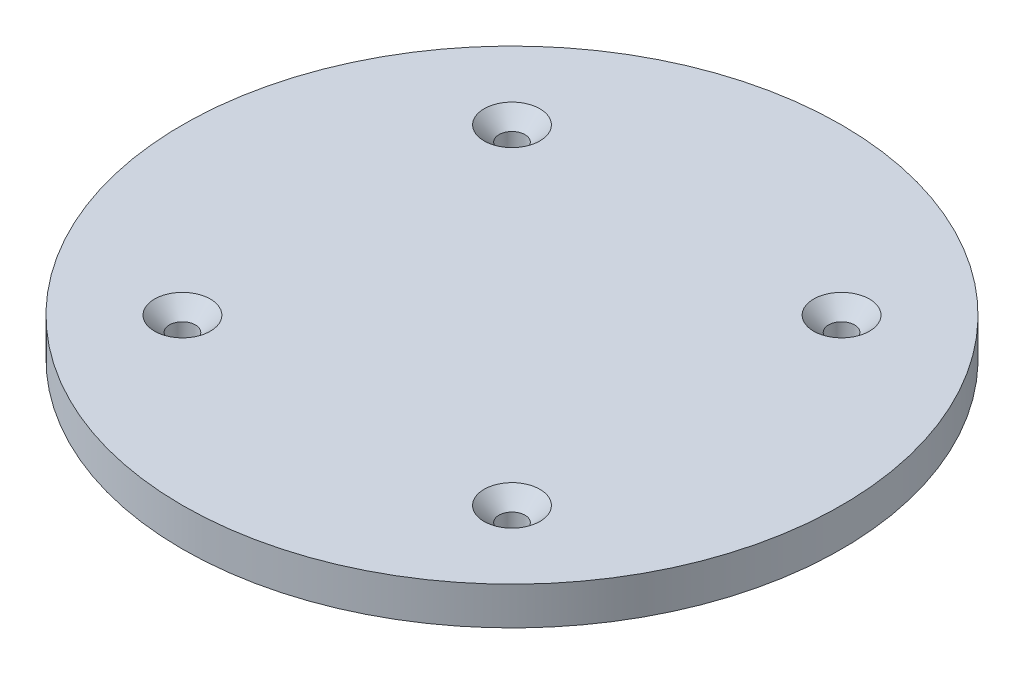
ISO-10303-21;
HEADER;
FILE_DESCRIPTION(('STEP AP214'),'2;1');
FILE_NAME('part.step','',(''),(''),'','','');
FILE_SCHEMA(('AUTOMOTIVE_DESIGN { 1 0 10303 214 1 1 1 1 }'));
ENDSEC;
DATA;
#1=APPLICATION_CONTEXT('core data for automotive mechanical design processes');
#2=APPLICATION_PROTOCOL_DEFINITION('international standard','automotive_design',2000,#1);
#3=PRODUCT_CONTEXT('',#1,'mechanical');
#4=PRODUCT('Part','Part','',(#3));
#5=PRODUCT_RELATED_PRODUCT_CATEGORY('part','',(#4));
#6=PRODUCT_DEFINITION_FORMATION('','',#4);
#7=PRODUCT_DEFINITION_CONTEXT('part definition',#1,'design');
#8=PRODUCT_DEFINITION('design','',#6,#7);
#9=PRODUCT_DEFINITION_SHAPE('','',#8);
#10=(LENGTH_UNIT() NAMED_UNIT(*) SI_UNIT(.MILLI.,.METRE.));
#11=(NAMED_UNIT(*) PLANE_ANGLE_UNIT() SI_UNIT($,.RADIAN.));
#12=(NAMED_UNIT(*) SI_UNIT($,.STERADIAN.) SOLID_ANGLE_UNIT());
#13=UNCERTAINTY_MEASURE_WITH_UNIT(LENGTH_MEASURE(1.E-05),#10,'distance_accuracy_value','');
#14=(GEOMETRIC_REPRESENTATION_CONTEXT(3) GLOBAL_UNCERTAINTY_ASSIGNED_CONTEXT((#13)) GLOBAL_UNIT_ASSIGNED_CONTEXT((#10,
#11,#12)) REPRESENTATION_CONTEXT('',''));
#15=CARTESIAN_POINT('',(0.,0.,0.));
#16=DIRECTION('',(0.,0.,1.));
#17=DIRECTION('',(1.,0.,0.));
#18=AXIS2_PLACEMENT_3D('',#15,#16,#17);
#19=CARTESIAN_POINT('',(-25.4,5.842,-25.4));
#20=DIRECTION('',(0.,-1.,0.));
#21=DIRECTION('',(0.,0.,-1.));
#22=AXIS2_PLACEMENT_3D('',#19,#20,#21);
#23=CYLINDRICAL_SURFACE('',#22,2.);
#24=CARTESIAN_POINT('',(-25.4,3.54199999999997,-25.4));
#25=DIRECTION('',(0.,1.,0.));
#26=DIRECTION('',(0.,0.,1.));
#27=AXIS2_PLACEMENT_3D('',#24,#25,#26);
#28=CIRCLE('',#27,2.);
#29=CARTESIAN_POINT('',(-25.4,3.54199999999997,-23.4));
#30=VERTEX_POINT('',#29);
#31=EDGE_CURVE('E49',#30,#30,#28,.T.);
#32=ORIENTED_EDGE('',*,*,#31,.T.);
#33=EDGE_LOOP('',(#32));
#34=FACE_BOUND('',#33,.T.);
#35=CARTESIAN_POINT('',(-25.4,0.,-25.4));
#36=DIRECTION('',(0.,1.,0.));
#37=DIRECTION('',(0.,0.,1.));
#38=AXIS2_PLACEMENT_3D('',#35,#36,#37);
#39=CIRCLE('',#38,2.);
#40=CARTESIAN_POINT('',(-25.4,0.,-23.4));
#41=VERTEX_POINT('',#40);
#42=EDGE_CURVE('E78',#41,#41,#39,.T.);
#43=ORIENTED_EDGE('',*,*,#42,.F.);
#44=EDGE_LOOP('',(#43));
#45=FACE_BOUND('',#44,.T.);
#46=ADVANCED_FACE('F41',(#34,#45),#23,.F.);
#47=CARTESIAN_POINT('',(25.4,5.842,25.4));
#48=DIRECTION('',(0.,-1.,0.));
#49=DIRECTION('',(0.,0.,-1.));
#50=AXIS2_PLACEMENT_3D('',#47,#48,#49);
#51=CYLINDRICAL_SURFACE('',#50,2.);
#52=CARTESIAN_POINT('',(25.4,3.54199999999997,25.4));
#53=DIRECTION('',(0.,1.,0.));
#54=DIRECTION('',(0.,0.,1.));
#55=AXIS2_PLACEMENT_3D('',#52,#53,#54);
#56=CIRCLE('',#55,2.);
#57=CARTESIAN_POINT('',(25.4,3.54199999999997,27.4));
#58=VERTEX_POINT('',#57);
#59=EDGE_CURVE('E71',#58,#58,#56,.T.);
#60=ORIENTED_EDGE('',*,*,#59,.T.);
#61=EDGE_LOOP('',(#60));
#62=FACE_BOUND('',#61,.T.);
#63=CARTESIAN_POINT('',(25.4,0.,25.4));
#64=DIRECTION('',(0.,1.,0.));
#65=DIRECTION('',(0.,0.,1.));
#66=AXIS2_PLACEMENT_3D('',#63,#64,#65);
#67=CIRCLE('',#66,2.);
#68=CARTESIAN_POINT('',(25.4,0.,27.4));
#69=VERTEX_POINT('',#68);
#70=EDGE_CURVE('E81',#69,#69,#67,.T.);
#71=ORIENTED_EDGE('',*,*,#70,.F.);
#72=EDGE_LOOP('',(#71));
#73=FACE_BOUND('',#72,.T.);
#74=ADVANCED_FACE('F118',(#62,#73),#51,.F.);
#75=CARTESIAN_POINT('',(25.4,5.842,-25.4));
#76=DIRECTION('',(0.,-1.,0.));
#77=DIRECTION('',(0.,0.,-1.));
#78=AXIS2_PLACEMENT_3D('',#75,#76,#77);
#79=CYLINDRICAL_SURFACE('',#78,2.);
#80=CARTESIAN_POINT('',(25.4,3.54199999999997,-25.4));
#81=DIRECTION('',(0.,1.,0.));
#82=DIRECTION('',(0.,0.,1.));
#83=AXIS2_PLACEMENT_3D('',#80,#81,#82);
#84=CIRCLE('',#83,2.);
#85=CARTESIAN_POINT('',(25.4,3.54199999999997,-23.4));
#86=VERTEX_POINT('',#85);
#87=EDGE_CURVE('E53',#86,#86,#84,.T.);
#88=ORIENTED_EDGE('',*,*,#87,.T.);
#89=EDGE_LOOP('',(#88));
#90=FACE_BOUND('',#89,.T.);
#91=CARTESIAN_POINT('',(25.4,0.,-25.4));
#92=DIRECTION('',(0.,1.,0.));
#93=DIRECTION('',(0.,0.,1.));
#94=AXIS2_PLACEMENT_3D('',#91,#92,#93);
#95=CIRCLE('',#94,2.);
#96=CARTESIAN_POINT('',(25.4,0.,-23.4));
#97=VERTEX_POINT('',#96);
#98=EDGE_CURVE('E84',#97,#97,#95,.T.);
#99=ORIENTED_EDGE('',*,*,#98,.F.);
#100=EDGE_LOOP('',(#99));
#101=FACE_BOUND('',#100,.T.);
#102=ADVANCED_FACE('F123',(#90,#101),#79,.F.);
#103=CARTESIAN_POINT('',(-25.4,5.842,25.4));
#104=DIRECTION('',(0.,-1.,0.));
#105=DIRECTION('',(0.,0.,-1.));
#106=AXIS2_PLACEMENT_3D('',#103,#104,#105);
#107=CYLINDRICAL_SURFACE('',#106,2.);
#108=CARTESIAN_POINT('',(-25.4,3.54199999999997,25.4));
#109=DIRECTION('',(0.,1.,0.));
#110=DIRECTION('',(0.,0.,1.));
#111=AXIS2_PLACEMENT_3D('',#108,#109,#110);
#112=CIRCLE('',#111,2.);
#113=CARTESIAN_POINT('',(-25.4,3.54199999999997,27.4));
#114=VERTEX_POINT('',#113);
#115=EDGE_CURVE('E10',#114,#114,#112,.T.);
#116=ORIENTED_EDGE('',*,*,#115,.T.);
#117=EDGE_LOOP('',(#116));
#118=FACE_BOUND('',#117,.T.);
#119=CARTESIAN_POINT('',(-25.4,0.,25.4));
#120=DIRECTION('',(0.,1.,0.));
#121=DIRECTION('',(0.,0.,1.));
#122=AXIS2_PLACEMENT_3D('',#119,#120,#121);
#123=CIRCLE('',#122,2.);
#124=CARTESIAN_POINT('',(-25.4,0.,27.4));
#125=VERTEX_POINT('',#124);
#126=EDGE_CURVE('E87',#125,#125,#123,.T.);
#127=ORIENTED_EDGE('',*,*,#126,.F.);
#128=EDGE_LOOP('',(#127));
#129=FACE_BOUND('',#128,.T.);
#130=ADVANCED_FACE('F98',(#118,#129),#107,.F.);
#131=CARTESIAN_POINT('',(0.,5.842,0.));
#132=DIRECTION('',(0.,-1.,0.));
#133=DIRECTION('',(0.,0.,-1.));
#134=AXIS2_PLACEMENT_3D('',#131,#132,#133);
#135=CYLINDRICAL_SURFACE('',#134,50.8);
#136=CARTESIAN_POINT('',(0.,5.842,0.));
#137=DIRECTION('',(0.,1.,0.));
#138=DIRECTION('',(0.,0.,1.));
#139=AXIS2_PLACEMENT_3D('',#136,#137,#138);
#140=CIRCLE('',#139,50.8);
#141=CARTESIAN_POINT('',(0.,5.842,50.8));
#142=VERTEX_POINT('',#141);
#143=EDGE_CURVE('E74',#142,#142,#140,.T.);
#144=ORIENTED_EDGE('',*,*,#143,.F.);
#145=EDGE_LOOP('',(#144));
#146=FACE_BOUND('',#145,.T.);
#147=CARTESIAN_POINT('',(0.,0.,0.));
#148=DIRECTION('',(0.,1.,0.));
#149=DIRECTION('',(0.,0.,1.));
#150=AXIS2_PLACEMENT_3D('',#147,#148,#149);
#151=CIRCLE('',#150,50.8);
#152=CARTESIAN_POINT('',(0.,0.,50.8));
#153=VERTEX_POINT('',#152);
#154=EDGE_CURVE('E75',#153,#153,#151,.T.);
#155=ORIENTED_EDGE('',*,*,#154,.T.);
#156=EDGE_LOOP('',(#155));
#157=FACE_BOUND('',#156,.T.);
#158=ADVANCED_FACE('F95',(#146,#157),#135,.T.);
#159=CARTESIAN_POINT('',(0.,5.842,0.));
#160=DIRECTION('',(0.,1.,0.));
#161=DIRECTION('',(0.,0.,1.));
#162=AXIS2_PLACEMENT_3D('',#159,#160,#161);
#163=PLANE('',#162);
#164=CARTESIAN_POINT('',(25.4,5.842,25.4));
#165=DIRECTION('',(0.,1.,0.));
#166=DIRECTION('',(0.,0.,1.));
#167=AXIS2_PLACEMENT_3D('',#164,#165,#166);
#168=CIRCLE('',#167,4.30000000000004);
#169=CARTESIAN_POINT('',(25.4,5.842,29.7));
#170=VERTEX_POINT('',#169);
#171=EDGE_CURVE('E57',#170,#170,#168,.F.);
#172=ORIENTED_EDGE('',*,*,#171,.T.);
#173=EDGE_LOOP('',(#172));
#174=FACE_BOUND('',#173,.T.);
#175=CARTESIAN_POINT('',(25.4,5.842,-25.4));
#176=DIRECTION('',(0.,1.,0.));
#177=DIRECTION('',(0.,0.,1.));
#178=AXIS2_PLACEMENT_3D('',#175,#176,#177);
#179=CIRCLE('',#178,4.30000000000004);
#180=CARTESIAN_POINT('',(25.4,5.842,-21.1));
#181=VERTEX_POINT('',#180);
#182=EDGE_CURVE('E62',#181,#181,#179,.F.);
#183=ORIENTED_EDGE('',*,*,#182,.T.);
#184=EDGE_LOOP('',(#183));
#185=FACE_BOUND('',#184,.T.);
#186=CARTESIAN_POINT('',(-25.4,5.842,-25.4));
#187=DIRECTION('',(0.,1.,0.));
#188=DIRECTION('',(0.,0.,1.));
#189=AXIS2_PLACEMENT_3D('',#186,#187,#188);
#190=CIRCLE('',#189,4.30000000000004);
#191=CARTESIAN_POINT('',(-25.4,5.842,-21.1));
#192=VERTEX_POINT('',#191);
#193=EDGE_CURVE('E65',#192,#192,#190,.F.);
#194=ORIENTED_EDGE('',*,*,#193,.T.);
#195=EDGE_LOOP('',(#194));
#196=FACE_BOUND('',#195,.T.);
#197=CARTESIAN_POINT('',(-25.4,5.842,25.4));
#198=DIRECTION('',(0.,1.,0.));
#199=DIRECTION('',(0.,0.,1.));
#200=AXIS2_PLACEMENT_3D('',#197,#198,#199);
#201=CIRCLE('',#200,4.30000000000004);
#202=CARTESIAN_POINT('',(-25.4,5.842,29.7));
#203=VERTEX_POINT('',#202);
#204=EDGE_CURVE('E68',#203,#203,#201,.F.);
#205=ORIENTED_EDGE('',*,*,#204,.T.);
#206=EDGE_LOOP('',(#205));
#207=FACE_BOUND('',#206,.T.);
#208=ORIENTED_EDGE('',*,*,#143,.T.);
#209=EDGE_LOOP('',(#208));
#210=FACE_BOUND('',#209,.T.);
#211=ADVANCED_FACE('F93',(#174,#185,#196,#207,#210),#163,.T.);
#212=CARTESIAN_POINT('',(0.,0.,0.));
#213=DIRECTION('',(0.,1.,0.));
#214=DIRECTION('',(0.,0.,1.));
#215=AXIS2_PLACEMENT_3D('',#212,#213,#214);
#216=PLANE('',#215);
#217=ORIENTED_EDGE('',*,*,#126,.T.);
#218=EDGE_LOOP('',(#217));
#219=FACE_BOUND('',#218,.T.);
#220=ORIENTED_EDGE('',*,*,#98,.T.);
#221=EDGE_LOOP('',(#220));
#222=FACE_BOUND('',#221,.T.);
#223=ORIENTED_EDGE('',*,*,#70,.T.);
#224=EDGE_LOOP('',(#223));
#225=FACE_BOUND('',#224,.T.);
#226=ORIENTED_EDGE('',*,*,#42,.T.);
#227=EDGE_LOOP('',(#226));
#228=FACE_BOUND('',#227,.T.);
#229=ORIENTED_EDGE('',*,*,#154,.F.);
#230=EDGE_LOOP('',(#229));
#231=FACE_BOUND('',#230,.T.);
#232=ADVANCED_FACE('F102',(#219,#222,#225,#228,#231),#216,.F.);
#233=CARTESIAN_POINT('',(25.4,3.54199999999997,25.4));
#234=DIRECTION('',(0.,1.,0.));
#235=DIRECTION('',(0.,0.,1.));
#236=AXIS2_PLACEMENT_3D('',#233,#234,#235);
#237=CONICAL_SURFACE('',#236,2.,0.785398163397451);
#238=ORIENTED_EDGE('',*,*,#171,.F.);
#239=EDGE_LOOP('',(#238));
#240=FACE_BOUND('',#239,.T.);
#241=ORIENTED_EDGE('',*,*,#59,.F.);
#242=EDGE_LOOP('',(#241));
#243=FACE_BOUND('',#242,.T.);
#244=ADVANCED_FACE('F104',(#240,#243),#237,.F.);
#245=CARTESIAN_POINT('',(25.4,3.54199999999997,-25.4));
#246=DIRECTION('',(0.,1.,0.));
#247=DIRECTION('',(0.,0.,1.));
#248=AXIS2_PLACEMENT_3D('',#245,#246,#247);
#249=CONICAL_SURFACE('',#248,2.,0.785398163397451);
#250=ORIENTED_EDGE('',*,*,#182,.F.);
#251=EDGE_LOOP('',(#250));
#252=FACE_BOUND('',#251,.T.);
#253=ORIENTED_EDGE('',*,*,#87,.F.);
#254=EDGE_LOOP('',(#253));
#255=FACE_BOUND('',#254,.T.);
#256=ADVANCED_FACE('F111',(#252,#255),#249,.F.);
#257=CARTESIAN_POINT('',(-25.4,3.54199999999997,-25.4));
#258=DIRECTION('',(0.,1.,0.));
#259=DIRECTION('',(0.,0.,1.));
#260=AXIS2_PLACEMENT_3D('',#257,#258,#259);
#261=CONICAL_SURFACE('',#260,2.,0.785398163397451);
#262=ORIENTED_EDGE('',*,*,#193,.F.);
#263=EDGE_LOOP('',(#262));
#264=FACE_BOUND('',#263,.T.);
#265=ORIENTED_EDGE('',*,*,#31,.F.);
#266=EDGE_LOOP('',(#265));
#267=FACE_BOUND('',#266,.T.);
#268=ADVANCED_FACE('F141',(#264,#267),#261,.F.);
#269=CARTESIAN_POINT('',(-25.4,3.54199999999997,25.4));
#270=DIRECTION('',(0.,1.,0.));
#271=DIRECTION('',(0.,0.,1.));
#272=AXIS2_PLACEMENT_3D('',#269,#270,#271);
#273=CONICAL_SURFACE('',#272,2.,0.785398163397451);
#274=ORIENTED_EDGE('',*,*,#204,.F.);
#275=EDGE_LOOP('',(#274));
#276=FACE_BOUND('',#275,.T.);
#277=ORIENTED_EDGE('',*,*,#115,.F.);
#278=EDGE_LOOP('',(#277));
#279=FACE_BOUND('',#278,.T.);
#280=ADVANCED_FACE('F44',(#276,#279),#273,.F.);
#281=CLOSED_SHELL('',(#46,#74,#102,#130,#158,#211,#232,#244,#256,#268,#280));
#282=MANIFOLD_SOLID_BREP('B2',#281);
#283=ADVANCED_BREP_SHAPE_REPRESENTATION('',(#18,#282),#14);
#284=SHAPE_DEFINITION_REPRESENTATION(#9,#283);
ENDSEC;
END-ISO-10303-21;
